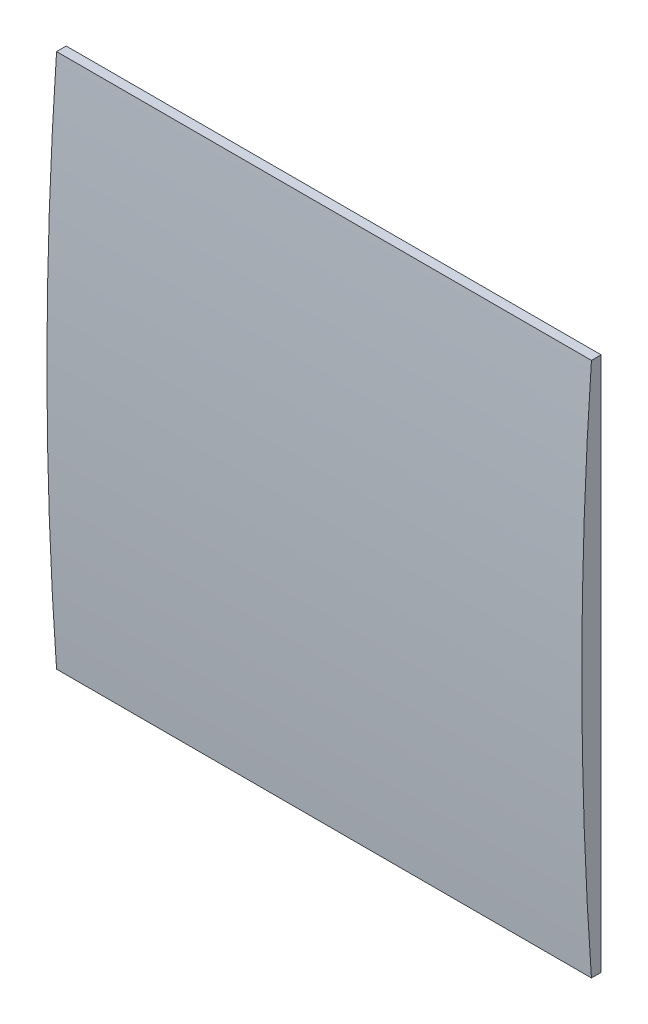
ISO-10303-21;
HEADER;
FILE_DESCRIPTION(('STEP AP214'),'2;1');
FILE_NAME('part.step','',(''),(''),'','','');
FILE_SCHEMA(('AUTOMOTIVE_DESIGN { 1 0 10303 214 1 1 1 1 }'));
ENDSEC;
DATA;
#1=APPLICATION_CONTEXT('core data for automotive mechanical design processes');
#2=APPLICATION_PROTOCOL_DEFINITION('international standard','automotive_design',2000,#1);
#3=PRODUCT_CONTEXT('',#1,'mechanical');
#4=PRODUCT('Part','Part','',(#3));
#5=PRODUCT_RELATED_PRODUCT_CATEGORY('part','',(#4));
#6=PRODUCT_DEFINITION_FORMATION('','',#4);
#7=PRODUCT_DEFINITION_CONTEXT('part definition',#1,'design');
#8=PRODUCT_DEFINITION('design','',#6,#7);
#9=PRODUCT_DEFINITION_SHAPE('','',#8);
#10=(LENGTH_UNIT() NAMED_UNIT(*) SI_UNIT(.MILLI.,.METRE.));
#11=(NAMED_UNIT(*) PLANE_ANGLE_UNIT() SI_UNIT($,.RADIAN.));
#12=(NAMED_UNIT(*) SI_UNIT($,.STERADIAN.) SOLID_ANGLE_UNIT());
#13=UNCERTAINTY_MEASURE_WITH_UNIT(LENGTH_MEASURE(1.E-05),#10,'distance_accuracy_value','');
#14=(GEOMETRIC_REPRESENTATION_CONTEXT(3) GLOBAL_UNCERTAINTY_ASSIGNED_CONTEXT((#13)) GLOBAL_UNIT_ASSIGNED_CONTEXT((#10,
#11,#12)) REPRESENTATION_CONTEXT('',''));
#15=CARTESIAN_POINT('',(0.,0.,0.));
#16=DIRECTION('',(0.,0.,1.));
#17=DIRECTION('',(1.,0.,0.));
#18=AXIS2_PLACEMENT_3D('',#15,#16,#17);
#19=CARTESIAN_POINT('',(27.7,0.,3.));
#20=DIRECTION('',(0.,1.,0.));
#21=DIRECTION('',(0.,0.,1.));
#22=AXIS2_PLACEMENT_3D('',#19,#20,#21);
#23=PLANE('',#22);
#24=DIRECTION('',(0.,0.,-1.));
#25=VECTOR('',#24,1.);
#26=CARTESIAN_POINT('',(0.,0.,3.));
#27=LINE('',#26,#25);
#28=CARTESIAN_POINT('',(0.,0.,3.));
#29=VERTEX_POINT('',#28);
#30=CARTESIAN_POINT('',(0.,0.,2.5));
#31=VERTEX_POINT('',#30);
#32=EDGE_CURVE('E97',#29,#31,#27,.T.);
#33=ORIENTED_EDGE('',*,*,#32,.T.);
#34=DIRECTION('',(-1.,0.,0.));
#35=VECTOR('',#34,1.);
#36=CARTESIAN_POINT('',(27.7,0.,2.5));
#37=LINE('',#36,#35);
#38=CARTESIAN_POINT('',(27.7,0.,2.5));
#39=VERTEX_POINT('',#38);
#40=EDGE_CURVE('E11',#39,#31,#37,.T.);
#41=ORIENTED_EDGE('',*,*,#40,.F.);
#42=DIRECTION('',(0.,0.,-1.));
#43=VECTOR('',#42,1.);
#44=CARTESIAN_POINT('',(27.7,0.,3.));
#45=LINE('',#44,#43);
#46=CARTESIAN_POINT('',(27.7,0.,3.));
#47=VERTEX_POINT('',#46);
#48=EDGE_CURVE('E83',#47,#39,#45,.T.);
#49=ORIENTED_EDGE('',*,*,#48,.F.);
#50=DIRECTION('',(-1.,0.,0.));
#51=VECTOR('',#50,1.);
#52=CARTESIAN_POINT('',(27.7,0.,3.));
#53=LINE('',#52,#51);
#54=EDGE_CURVE('E93',#47,#29,#53,.T.);
#55=ORIENTED_EDGE('',*,*,#54,.T.);
#56=EDGE_LOOP('',(#33,#41,#49,#55));
#57=FACE_BOUND('',#56,.T.);
#58=ADVANCED_FACE('F33',(#57),#23,.F.);
#59=CARTESIAN_POINT('',(27.7,27.7,2.5));
#60=DIRECTION('',(0.,0.,1.));
#61=DIRECTION('',(1.,0.,0.));
#62=AXIS2_PLACEMENT_3D('',#59,#60,#61);
#63=PLANE('',#62);
#64=DIRECTION('',(0.,1.,0.));
#65=VECTOR('',#64,1.);
#66=CARTESIAN_POINT('',(0.,27.7,2.5));
#67=LINE('',#66,#65);
#68=CARTESIAN_POINT('',(0.,27.7,2.5));
#69=VERTEX_POINT('',#68);
#70=EDGE_CURVE('E88',#31,#69,#67,.T.);
#71=ORIENTED_EDGE('',*,*,#70,.T.);
#72=DIRECTION('',(-1.,0.,0.));
#73=VECTOR('',#72,1.);
#74=CARTESIAN_POINT('',(27.7,27.7,2.5));
#75=LINE('',#74,#73);
#76=CARTESIAN_POINT('',(27.7,27.7,2.5));
#77=VERTEX_POINT('',#76);
#78=EDGE_CURVE('E41',#77,#69,#75,.T.);
#79=ORIENTED_EDGE('',*,*,#78,.F.);
#80=DIRECTION('',(0.,1.,0.));
#81=VECTOR('',#80,1.);
#82=CARTESIAN_POINT('',(27.7,27.7,2.5));
#83=LINE('',#82,#81);
#84=EDGE_CURVE('E77',#39,#77,#83,.T.);
#85=ORIENTED_EDGE('',*,*,#84,.F.);
#86=ORIENTED_EDGE('',*,*,#40,.T.);
#87=EDGE_LOOP('',(#71,#79,#85,#86));
#88=FACE_BOUND('',#87,.T.);
#89=ADVANCED_FACE('F87',(#88),#63,.F.);
#90=CARTESIAN_POINT('',(27.7,27.7,3.));
#91=DIRECTION('',(0.,-1.,0.));
#92=DIRECTION('',(0.,0.,-1.));
#93=AXIS2_PLACEMENT_3D('',#90,#91,#92);
#94=PLANE('',#93);
#95=DIRECTION('',(0.,0.,1.));
#96=VECTOR('',#95,1.);
#97=CARTESIAN_POINT('',(0.,27.7,3.));
#98=LINE('',#97,#96);
#99=CARTESIAN_POINT('',(0.,27.7,3.));
#100=VERTEX_POINT('',#99);
#101=EDGE_CURVE('E101',#69,#100,#98,.T.);
#102=ORIENTED_EDGE('',*,*,#101,.T.);
#103=DIRECTION('',(-1.,0.,0.));
#104=VECTOR('',#103,1.);
#105=CARTESIAN_POINT('',(27.7,27.7,3.));
#106=LINE('',#105,#104);
#107=CARTESIAN_POINT('',(27.7,27.7,3.));
#108=VERTEX_POINT('',#107);
#109=EDGE_CURVE('E90',#108,#100,#106,.T.);
#110=ORIENTED_EDGE('',*,*,#109,.F.);
#111=DIRECTION('',(0.,0.,1.));
#112=VECTOR('',#111,1.);
#113=CARTESIAN_POINT('',(27.7,27.7,3.));
#114=LINE('',#113,#112);
#115=EDGE_CURVE('E80',#77,#108,#114,.T.);
#116=ORIENTED_EDGE('',*,*,#115,.F.);
#117=ORIENTED_EDGE('',*,*,#78,.T.);
#118=EDGE_LOOP('',(#102,#110,#116,#117));
#119=FACE_BOUND('',#118,.T.);
#120=ADVANCED_FACE('F91',(#119),#94,.F.);
#121=CARTESIAN_POINT('',(27.7,13.85,-188.572500000003));
#122=DIRECTION('',(-1.,0.,0.));
#123=DIRECTION('',(0.,0.,1.));
#124=AXIS2_PLACEMENT_3D('',#121,#122,#123);
#125=CYLINDRICAL_SURFACE('',#124,192.072500000003);
#126=CARTESIAN_POINT('',(0.,13.85,-188.572500000003));
#127=DIRECTION('',(1.,0.,0.));
#128=DIRECTION('',(0.,0.,-1.));
#129=AXIS2_PLACEMENT_3D('',#126,#127,#128);
#130=CIRCLE('',#129,192.072500000003);
#131=EDGE_CURVE('E66',#100,#29,#130,.T.);
#132=ORIENTED_EDGE('',*,*,#131,.T.);
#133=ORIENTED_EDGE('',*,*,#54,.F.);
#134=CARTESIAN_POINT('',(27.7,13.8499999999972,-188.57250000008));
#135=DIRECTION('',(1.,0.,0.));
#136=DIRECTION('',(0.,0.,1.));
#137=AXIS2_PLACEMENT_3D('',#134,#135,#136);
#138=CIRCLE('',#137,192.07250000008);
#139=EDGE_CURVE('E49',#108,#47,#138,.T.);
#140=ORIENTED_EDGE('',*,*,#139,.F.);
#141=ORIENTED_EDGE('',*,*,#109,.T.);
#142=EDGE_LOOP('',(#132,#133,#140,#141));
#143=FACE_BOUND('',#142,.T.);
#144=ADVANCED_FACE('F105',(#143),#125,.T.);
#145=CARTESIAN_POINT('',(27.7,13.8499999999972,-188.57250000008));
#146=DIRECTION('',(-1.,0.,0.));
#147=DIRECTION('',(0.,0.,1.));
#148=AXIS2_PLACEMENT_3D('',#145,#146,#147);
#149=PLANE('',#148);
#150=ORIENTED_EDGE('',*,*,#48,.T.);
#151=ORIENTED_EDGE('',*,*,#84,.T.);
#152=ORIENTED_EDGE('',*,*,#115,.T.);
#153=ORIENTED_EDGE('',*,*,#139,.T.);
#154=EDGE_LOOP('',(#150,#151,#152,#153));
#155=FACE_BOUND('',#154,.T.);
#156=ADVANCED_FACE('F78',(#155),#149,.F.);
#157=CARTESIAN_POINT('',(0.,13.8499999999972,-188.57250000008));
#158=DIRECTION('',(-1.,0.,0.));
#159=DIRECTION('',(0.,0.,1.));
#160=AXIS2_PLACEMENT_3D('',#157,#158,#159);
#161=PLANE('',#160);
#162=ORIENTED_EDGE('',*,*,#32,.F.);
#163=ORIENTED_EDGE('',*,*,#131,.F.);
#164=ORIENTED_EDGE('',*,*,#101,.F.);
#165=ORIENTED_EDGE('',*,*,#70,.F.);
#166=EDGE_LOOP('',(#162,#163,#164,#165));
#167=FACE_BOUND('',#166,.T.);
#168=ADVANCED_FACE('F107',(#167),#161,.T.);
#169=CLOSED_SHELL('',(#58,#89,#120,#144,#156,#168));
#170=MANIFOLD_SOLID_BREP('B2',#169);
#171=ADVANCED_BREP_SHAPE_REPRESENTATION('',(#18,#170),#14);
#172=SHAPE_DEFINITION_REPRESENTATION(#9,#171);
ENDSEC;
END-ISO-10303-21;
